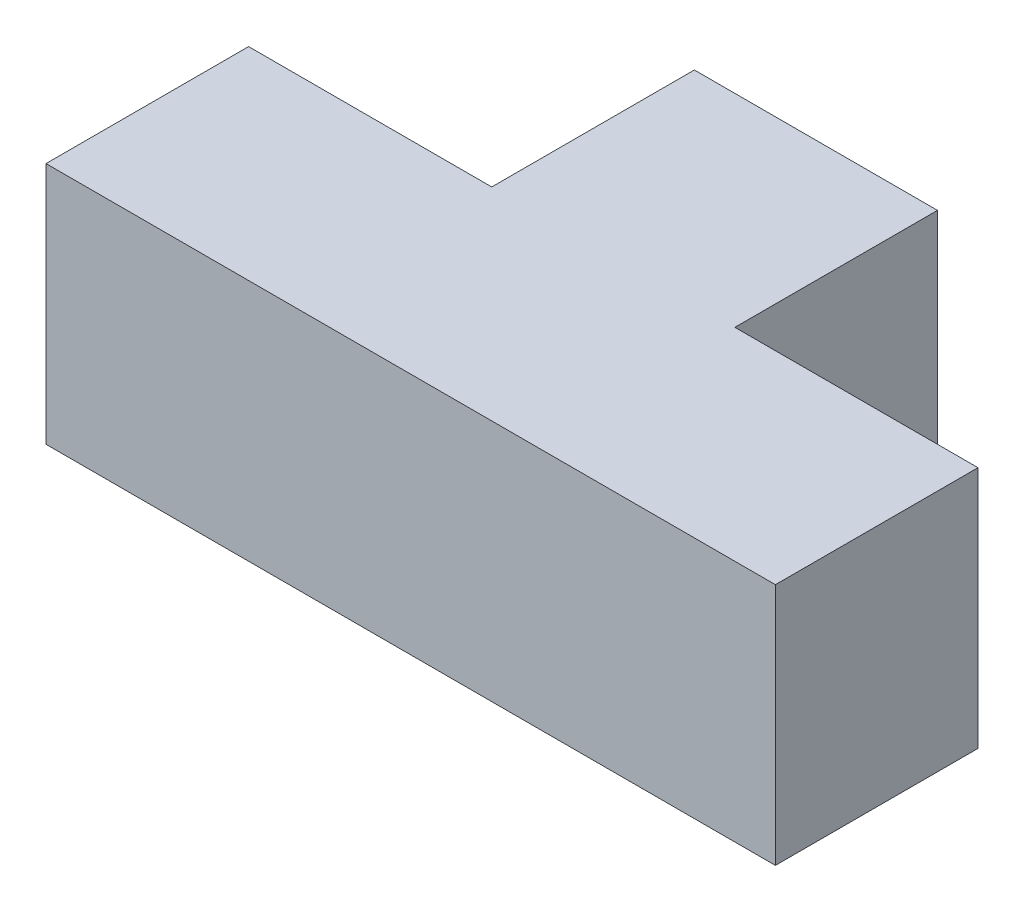
ISO-10303-21;
HEADER;
FILE_DESCRIPTION(('STEP AP214'),'2;1');
FILE_NAME('part.step','',(''),(''),'','','');
FILE_SCHEMA(('AUTOMOTIVE_DESIGN { 1 0 10303 214 1 1 1 1 }'));
ENDSEC;
DATA;
#1=APPLICATION_CONTEXT('core data for automotive mechanical design processes');
#2=APPLICATION_PROTOCOL_DEFINITION('international standard','automotive_design',2000,#1);
#3=PRODUCT_CONTEXT('',#1,'mechanical');
#4=PRODUCT('Part','Part','',(#3));
#5=PRODUCT_RELATED_PRODUCT_CATEGORY('part','',(#4));
#6=PRODUCT_DEFINITION_FORMATION('','',#4);
#7=PRODUCT_DEFINITION_CONTEXT('part definition',#1,'design');
#8=PRODUCT_DEFINITION('design','',#6,#7);
#9=PRODUCT_DEFINITION_SHAPE('','',#8);
#10=(LENGTH_UNIT() NAMED_UNIT(*) SI_UNIT(.MILLI.,.METRE.));
#11=(NAMED_UNIT(*) PLANE_ANGLE_UNIT() SI_UNIT($,.RADIAN.));
#12=(NAMED_UNIT(*) SI_UNIT($,.STERADIAN.) SOLID_ANGLE_UNIT());
#13=UNCERTAINTY_MEASURE_WITH_UNIT(LENGTH_MEASURE(1.E-05),#10,'distance_accuracy_value','');
#14=(GEOMETRIC_REPRESENTATION_CONTEXT(3) GLOBAL_UNCERTAINTY_ASSIGNED_CONTEXT((#13)) GLOBAL_UNIT_ASSIGNED_CONTEXT((#10,
#11,#12)) REPRESENTATION_CONTEXT('',''));
#15=CARTESIAN_POINT('',(0.,0.,0.));
#16=DIRECTION('',(0.,0.,1.));
#17=DIRECTION('',(1.,0.,0.));
#18=AXIS2_PLACEMENT_3D('',#15,#16,#17);
#19=CARTESIAN_POINT('',(45.,30.,0.));
#20=DIRECTION('',(-1.,0.,0.));
#21=DIRECTION('',(0.,0.,1.));
#22=AXIS2_PLACEMENT_3D('',#19,#20,#21);
#23=PLANE('',#22);
#24=DIRECTION('',(0.,0.,-1.));
#25=VECTOR('',#24,1.);
#26=CARTESIAN_POINT('',(45.,0.,0.));
#27=LINE('',#26,#25);
#28=CARTESIAN_POINT('',(45.,0.,0.));
#29=VERTEX_POINT('',#28);
#30=CARTESIAN_POINT('',(45.,0.,-25.));
#31=VERTEX_POINT('',#30);
#32=EDGE_CURVE('E129',#29,#31,#27,.T.);
#33=ORIENTED_EDGE('',*,*,#32,.T.);
#34=DIRECTION('',(0.,-1.,0.));
#35=VECTOR('',#34,1.);
#36=CARTESIAN_POINT('',(45.,30.,-25.));
#37=LINE('',#36,#35);
#38=CARTESIAN_POINT('',(45.,30.,-25.));
#39=VERTEX_POINT('',#38);
#40=EDGE_CURVE('E11',#39,#31,#37,.T.);
#41=ORIENTED_EDGE('',*,*,#40,.F.);
#42=DIRECTION('',(0.,0.,-1.));
#43=VECTOR('',#42,1.);
#44=CARTESIAN_POINT('',(45.,30.,0.));
#45=LINE('',#44,#43);
#46=CARTESIAN_POINT('',(45.,30.,0.));
#47=VERTEX_POINT('',#46);
#48=EDGE_CURVE('E143',#47,#39,#45,.T.);
#49=ORIENTED_EDGE('',*,*,#48,.F.);
#50=DIRECTION('',(0.,-1.,0.));
#51=VECTOR('',#50,1.);
#52=CARTESIAN_POINT('',(45.,30.,0.));
#53=LINE('',#52,#51);
#54=EDGE_CURVE('E125',#47,#29,#53,.T.);
#55=ORIENTED_EDGE('',*,*,#54,.T.);
#56=EDGE_LOOP('',(#33,#41,#49,#55));
#57=FACE_BOUND('',#56,.T.);
#58=ADVANCED_FACE('F33',(#57),#23,.F.);
#59=CARTESIAN_POINT('',(45.,30.,-25.));
#60=DIRECTION('',(0.,0.,1.));
#61=DIRECTION('',(1.,0.,0.));
#62=AXIS2_PLACEMENT_3D('',#59,#60,#61);
#63=PLANE('',#62);
#64=DIRECTION('',(-1.,0.,0.));
#65=VECTOR('',#64,1.);
#66=CARTESIAN_POINT('',(45.,0.,-25.));
#67=LINE('',#66,#65);
#68=CARTESIAN_POINT('',(15.,0.,-25.));
#69=VERTEX_POINT('',#68);
#70=EDGE_CURVE('E132',#31,#69,#67,.T.);
#71=ORIENTED_EDGE('',*,*,#70,.T.);
#72=DIRECTION('',(0.,-1.,0.));
#73=VECTOR('',#72,1.);
#74=CARTESIAN_POINT('',(15.,30.,-25.));
#75=LINE('',#74,#73);
#76=CARTESIAN_POINT('',(15.,30.,-25.));
#77=VERTEX_POINT('',#76);
#78=EDGE_CURVE('E41',#77,#69,#75,.T.);
#79=ORIENTED_EDGE('',*,*,#78,.F.);
#80=DIRECTION('',(-1.,0.,0.));
#81=VECTOR('',#80,1.);
#82=CARTESIAN_POINT('',(45.,30.,-25.));
#83=LINE('',#82,#81);
#84=EDGE_CURVE('E92',#39,#77,#83,.T.);
#85=ORIENTED_EDGE('',*,*,#84,.F.);
#86=ORIENTED_EDGE('',*,*,#40,.T.);
#87=EDGE_LOOP('',(#71,#79,#85,#86));
#88=FACE_BOUND('',#87,.T.);
#89=ADVANCED_FACE('F178',(#88),#63,.F.);
#90=CARTESIAN_POINT('',(15.,30.,-25.));
#91=DIRECTION('',(-1.,0.,0.));
#92=DIRECTION('',(0.,0.,1.));
#93=AXIS2_PLACEMENT_3D('',#90,#91,#92);
#94=PLANE('',#93);
#95=DIRECTION('',(0.,0.,-1.));
#96=VECTOR('',#95,1.);
#97=CARTESIAN_POINT('',(15.,0.,-25.));
#98=LINE('',#97,#96);
#99=CARTESIAN_POINT('',(15.,0.,-50.));
#100=VERTEX_POINT('',#99);
#101=EDGE_CURVE('E134',#69,#100,#98,.T.);
#102=ORIENTED_EDGE('',*,*,#101,.T.);
#103=DIRECTION('',(0.,-1.,0.));
#104=VECTOR('',#103,1.);
#105=CARTESIAN_POINT('',(15.,30.,-50.));
#106=LINE('',#105,#104);
#107=CARTESIAN_POINT('',(15.,30.,-50.));
#108=VERTEX_POINT('',#107);
#109=EDGE_CURVE('E150',#108,#100,#106,.T.);
#110=ORIENTED_EDGE('',*,*,#109,.F.);
#111=DIRECTION('',(0.,0.,-1.));
#112=VECTOR('',#111,1.);
#113=CARTESIAN_POINT('',(15.,30.,-25.));
#114=LINE('',#113,#112);
#115=EDGE_CURVE('E158',#77,#108,#114,.T.);
#116=ORIENTED_EDGE('',*,*,#115,.F.);
#117=ORIENTED_EDGE('',*,*,#78,.T.);
#118=EDGE_LOOP('',(#102,#110,#116,#117));
#119=FACE_BOUND('',#118,.T.);
#120=ADVANCED_FACE('F156',(#119),#94,.F.);
#121=CARTESIAN_POINT('',(15.,30.,-50.));
#122=DIRECTION('',(0.,0.,1.));
#123=DIRECTION('',(1.,0.,0.));
#124=AXIS2_PLACEMENT_3D('',#121,#122,#123);
#125=PLANE('',#124);
#126=DIRECTION('',(-1.,0.,0.));
#127=VECTOR('',#126,1.);
#128=CARTESIAN_POINT('',(15.,0.,-50.));
#129=LINE('',#128,#127);
#130=CARTESIAN_POINT('',(-15.,0.,-50.));
#131=VERTEX_POINT('',#130);
#132=EDGE_CURVE('E136',#100,#131,#129,.T.);
#133=ORIENTED_EDGE('',*,*,#132,.T.);
#134=DIRECTION('',(0.,-1.,0.));
#135=VECTOR('',#134,1.);
#136=CARTESIAN_POINT('',(-15.,30.,-50.));
#137=LINE('',#136,#135);
#138=CARTESIAN_POINT('',(-15.,30.,-50.));
#139=VERTEX_POINT('',#138);
#140=EDGE_CURVE('E147',#139,#131,#137,.T.);
#141=ORIENTED_EDGE('',*,*,#140,.F.);
#142=DIRECTION('',(-1.,0.,0.));
#143=VECTOR('',#142,1.);
#144=CARTESIAN_POINT('',(15.,30.,-50.));
#145=LINE('',#144,#143);
#146=EDGE_CURVE('E170',#108,#139,#145,.T.);
#147=ORIENTED_EDGE('',*,*,#146,.F.);
#148=ORIENTED_EDGE('',*,*,#109,.T.);
#149=EDGE_LOOP('',(#133,#141,#147,#148));
#150=FACE_BOUND('',#149,.T.);
#151=ADVANCED_FACE('F166',(#150),#125,.F.);
#152=CARTESIAN_POINT('',(-15.,30.,-25.));
#153=DIRECTION('',(1.,0.,0.));
#154=DIRECTION('',(0.,0.,-1.));
#155=AXIS2_PLACEMENT_3D('',#152,#153,#154);
#156=PLANE('',#155);
#157=DIRECTION('',(0.,0.,1.));
#158=VECTOR('',#157,1.);
#159=CARTESIAN_POINT('',(-15.,0.,-25.));
#160=LINE('',#159,#158);
#161=CARTESIAN_POINT('',(-15.,0.,-25.));
#162=VERTEX_POINT('',#161);
#163=EDGE_CURVE('E138',#131,#162,#160,.T.);
#164=ORIENTED_EDGE('',*,*,#163,.T.);
#165=DIRECTION('',(0.,-1.,0.));
#166=VECTOR('',#165,1.);
#167=CARTESIAN_POINT('',(-15.,30.,-25.));
#168=LINE('',#167,#166);
#169=CARTESIAN_POINT('',(-15.,30.,-25.));
#170=VERTEX_POINT('',#169);
#171=EDGE_CURVE('E120',#170,#162,#168,.T.);
#172=ORIENTED_EDGE('',*,*,#171,.F.);
#173=DIRECTION('',(0.,0.,1.));
#174=VECTOR('',#173,1.);
#175=CARTESIAN_POINT('',(-15.,30.,-25.));
#176=LINE('',#175,#174);
#177=EDGE_CURVE('E111',#139,#170,#176,.T.);
#178=ORIENTED_EDGE('',*,*,#177,.F.);
#179=ORIENTED_EDGE('',*,*,#140,.T.);
#180=EDGE_LOOP('',(#164,#172,#178,#179));
#181=FACE_BOUND('',#180,.T.);
#182=ADVANCED_FACE('F169',(#181),#156,.F.);
#183=CARTESIAN_POINT('',(-45.,30.,-25.));
#184=DIRECTION('',(0.,0.,1.));
#185=DIRECTION('',(1.,0.,0.));
#186=AXIS2_PLACEMENT_3D('',#183,#184,#185);
#187=PLANE('',#186);
#188=DIRECTION('',(-1.,0.,0.));
#189=VECTOR('',#188,1.);
#190=CARTESIAN_POINT('',(-45.,0.,-25.));
#191=LINE('',#190,#189);
#192=CARTESIAN_POINT('',(-45.,0.,-25.));
#193=VERTEX_POINT('',#192);
#194=EDGE_CURVE('E119',#162,#193,#191,.T.);
#195=ORIENTED_EDGE('',*,*,#194,.T.);
#196=DIRECTION('',(0.,-1.,0.));
#197=VECTOR('',#196,1.);
#198=CARTESIAN_POINT('',(-45.,30.,-25.));
#199=LINE('',#198,#197);
#200=CARTESIAN_POINT('',(-45.,30.,-25.));
#201=VERTEX_POINT('',#200);
#202=EDGE_CURVE('E116',#201,#193,#199,.T.);
#203=ORIENTED_EDGE('',*,*,#202,.F.);
#204=DIRECTION('',(-1.,0.,0.));
#205=VECTOR('',#204,1.);
#206=CARTESIAN_POINT('',(-45.,30.,-25.));
#207=LINE('',#206,#205);
#208=EDGE_CURVE('E105',#170,#201,#207,.T.);
#209=ORIENTED_EDGE('',*,*,#208,.F.);
#210=ORIENTED_EDGE('',*,*,#171,.T.);
#211=EDGE_LOOP('',(#195,#203,#209,#210));
#212=FACE_BOUND('',#211,.T.);
#213=ADVANCED_FACE('F117',(#212),#187,.F.);
#214=CARTESIAN_POINT('',(-45.,30.,0.));
#215=DIRECTION('',(1.,0.,0.));
#216=DIRECTION('',(0.,0.,-1.));
#217=AXIS2_PLACEMENT_3D('',#214,#215,#216);
#218=PLANE('',#217);
#219=DIRECTION('',(0.,0.,1.));
#220=VECTOR('',#219,1.);
#221=CARTESIAN_POINT('',(-45.,0.,0.));
#222=LINE('',#221,#220);
#223=CARTESIAN_POINT('',(-45.,0.,0.));
#224=VERTEX_POINT('',#223);
#225=EDGE_CURVE('E78',#193,#224,#222,.T.);
#226=ORIENTED_EDGE('',*,*,#225,.T.);
#227=DIRECTION('',(0.,-1.,0.));
#228=VECTOR('',#227,1.);
#229=CARTESIAN_POINT('',(-45.,30.,0.));
#230=LINE('',#229,#228);
#231=CARTESIAN_POINT('',(-45.,30.,0.));
#232=VERTEX_POINT('',#231);
#233=EDGE_CURVE('E121',#232,#224,#230,.T.);
#234=ORIENTED_EDGE('',*,*,#233,.F.);
#235=DIRECTION('',(0.,0.,1.));
#236=VECTOR('',#235,1.);
#237=CARTESIAN_POINT('',(-45.,30.,0.));
#238=LINE('',#237,#236);
#239=EDGE_CURVE('E109',#201,#232,#238,.T.);
#240=ORIENTED_EDGE('',*,*,#239,.F.);
#241=ORIENTED_EDGE('',*,*,#202,.T.);
#242=EDGE_LOOP('',(#226,#234,#240,#241));
#243=FACE_BOUND('',#242,.T.);
#244=ADVANCED_FACE('F123',(#243),#218,.F.);
#245=CARTESIAN_POINT('',(-45.,30.,0.));
#246=DIRECTION('',(0.,0.,-1.));
#247=DIRECTION('',(-1.,0.,0.));
#248=AXIS2_PLACEMENT_3D('',#245,#246,#247);
#249=PLANE('',#248);
#250=DIRECTION('',(1.,0.,0.));
#251=VECTOR('',#250,1.);
#252=CARTESIAN_POINT('',(-45.,0.,0.));
#253=LINE('',#252,#251);
#254=EDGE_CURVE('E84',#224,#29,#253,.T.);
#255=ORIENTED_EDGE('',*,*,#254,.T.);
#256=ORIENTED_EDGE('',*,*,#54,.F.);
#257=DIRECTION('',(1.,0.,0.));
#258=VECTOR('',#257,1.);
#259=CARTESIAN_POINT('',(-45.,30.,0.));
#260=LINE('',#259,#258);
#261=EDGE_CURVE('E49',#232,#47,#260,.T.);
#262=ORIENTED_EDGE('',*,*,#261,.F.);
#263=ORIENTED_EDGE('',*,*,#233,.T.);
#264=EDGE_LOOP('',(#255,#256,#262,#263));
#265=FACE_BOUND('',#264,.T.);
#266=ADVANCED_FACE('F194',(#265),#249,.F.);
#267=CARTESIAN_POINT('',(0.,30.,0.));
#268=DIRECTION('',(0.,1.,0.));
#269=DIRECTION('',(0.,0.,1.));
#270=AXIS2_PLACEMENT_3D('',#267,#268,#269);
#271=PLANE('',#270);
#272=ORIENTED_EDGE('',*,*,#48,.T.);
#273=ORIENTED_EDGE('',*,*,#84,.T.);
#274=ORIENTED_EDGE('',*,*,#115,.T.);
#275=ORIENTED_EDGE('',*,*,#146,.T.);
#276=ORIENTED_EDGE('',*,*,#177,.T.);
#277=ORIENTED_EDGE('',*,*,#208,.T.);
#278=ORIENTED_EDGE('',*,*,#239,.T.);
#279=ORIENTED_EDGE('',*,*,#261,.T.);
#280=EDGE_LOOP('',(#272,#273,#274,#275,#276,#277,#278,#279));
#281=FACE_BOUND('',#280,.T.);
#282=ADVANCED_FACE('F107',(#281),#271,.T.);
#283=CARTESIAN_POINT('',(0.,0.,0.));
#284=DIRECTION('',(0.,1.,0.));
#285=DIRECTION('',(0.,0.,1.));
#286=AXIS2_PLACEMENT_3D('',#283,#284,#285);
#287=PLANE('',#286);
#288=ORIENTED_EDGE('',*,*,#32,.F.);
#289=ORIENTED_EDGE('',*,*,#254,.F.);
#290=ORIENTED_EDGE('',*,*,#225,.F.);
#291=ORIENTED_EDGE('',*,*,#194,.F.);
#292=ORIENTED_EDGE('',*,*,#163,.F.);
#293=ORIENTED_EDGE('',*,*,#132,.F.);
#294=ORIENTED_EDGE('',*,*,#101,.F.);
#295=ORIENTED_EDGE('',*,*,#70,.F.);
#296=EDGE_LOOP('',(#288,#289,#290,#291,#292,#293,#294,#295));
#297=FACE_BOUND('',#296,.T.);
#298=ADVANCED_FACE('F162',(#297),#287,.F.);
#299=CLOSED_SHELL('',(#58,#89,#120,#151,#182,#213,#244,#266,#282,#298));
#300=MANIFOLD_SOLID_BREP('B2',#299);
#301=ADVANCED_BREP_SHAPE_REPRESENTATION('',(#18,#300),#14);
#302=SHAPE_DEFINITION_REPRESENTATION(#9,#301);
ENDSEC;
END-ISO-10303-21;
